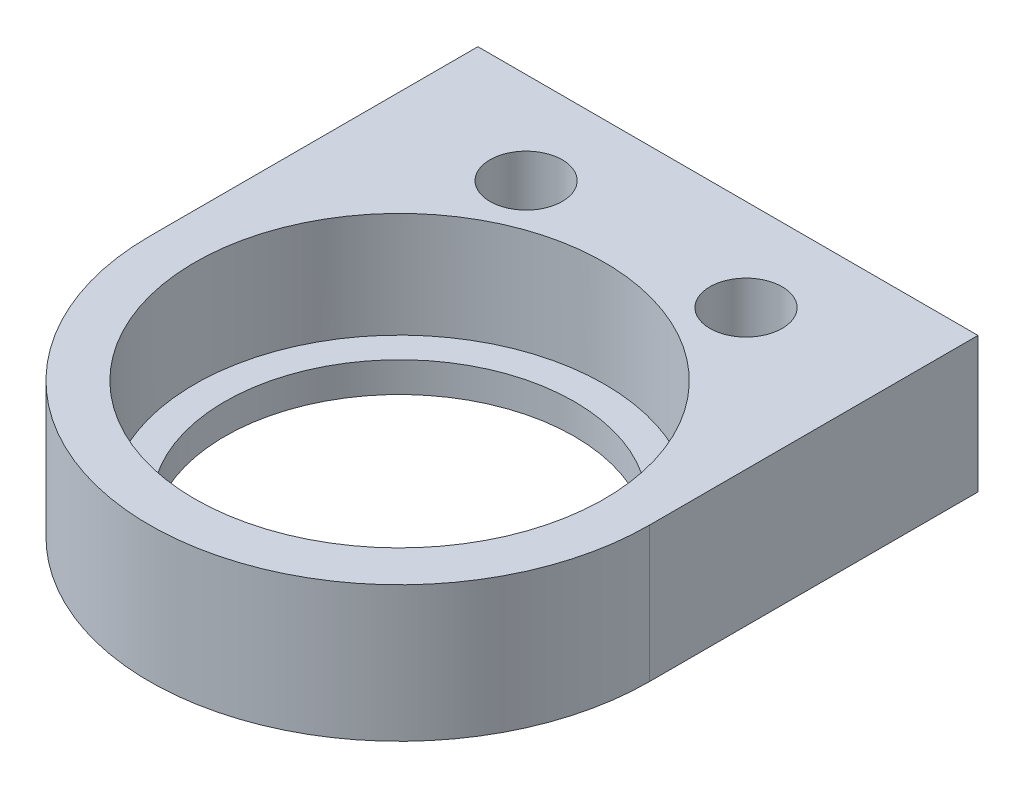
ISO-10303-21;
HEADER;
FILE_DESCRIPTION(('STEP AP214'),'2;1');
FILE_NAME('part.step','',(''),(''),'','','');
FILE_SCHEMA(('AUTOMOTIVE_DESIGN { 1 0 10303 214 1 1 1 1 }'));
ENDSEC;
DATA;
#1=APPLICATION_CONTEXT('core data for automotive mechanical design processes');
#2=APPLICATION_PROTOCOL_DEFINITION('international standard','automotive_design',2000,#1);
#3=PRODUCT_CONTEXT('',#1,'mechanical');
#4=PRODUCT('Part','Part','',(#3));
#5=PRODUCT_RELATED_PRODUCT_CATEGORY('part','',(#4));
#6=PRODUCT_DEFINITION_FORMATION('','',#4);
#7=PRODUCT_DEFINITION_CONTEXT('part definition',#1,'design');
#8=PRODUCT_DEFINITION('design','',#6,#7);
#9=PRODUCT_DEFINITION_SHAPE('','',#8);
#10=(LENGTH_UNIT() NAMED_UNIT(*) SI_UNIT(.MILLI.,.METRE.));
#11=(NAMED_UNIT(*) PLANE_ANGLE_UNIT() SI_UNIT($,.RADIAN.));
#12=(NAMED_UNIT(*) SI_UNIT($,.STERADIAN.) SOLID_ANGLE_UNIT());
#13=UNCERTAINTY_MEASURE_WITH_UNIT(LENGTH_MEASURE(1.E-05),#10,'distance_accuracy_value','');
#14=(GEOMETRIC_REPRESENTATION_CONTEXT(3) GLOBAL_UNCERTAINTY_ASSIGNED_CONTEXT((#13)) GLOBAL_UNIT_ASSIGNED_CONTEXT((#10,
#11,#12)) REPRESENTATION_CONTEXT('',''));
#15=CARTESIAN_POINT('',(0.,0.,0.));
#16=DIRECTION('',(0.,0.,1.));
#17=DIRECTION('',(1.,0.,0.));
#18=AXIS2_PLACEMENT_3D('',#15,#16,#17);
#19=CARTESIAN_POINT('',(0.,4.445,0.));
#20=DIRECTION('',(0.,-1.,0.));
#21=DIRECTION('',(0.,0.,-1.));
#22=AXIS2_PLACEMENT_3D('',#19,#20,#21);
#23=PLANE('',#22);
#24=CARTESIAN_POINT('',(4.6355,4.445,-9.9695));
#25=DIRECTION('',(0.,1.,0.));
#26=DIRECTION('',(0.,0.,1.));
#27=AXIS2_PLACEMENT_3D('',#24,#25,#26);
#28=CIRCLE('',#27,1.524);
#29=CARTESIAN_POINT('',(4.6355,4.445,-8.4455));
#30=VERTEX_POINT('',#29);
#31=EDGE_CURVE('E128',#30,#30,#28,.T.);
#32=ORIENTED_EDGE('',*,*,#31,.F.);
#33=EDGE_LOOP('',(#32));
#34=FACE_BOUND('',#33,.T.);
#35=CARTESIAN_POINT('',(-4.6355,4.445,-9.9695));
#36=DIRECTION('',(0.,1.,0.));
#37=DIRECTION('',(0.,0.,-1.));
#38=AXIS2_PLACEMENT_3D('',#35,#36,#37);
#39=CIRCLE('',#38,1.524);
#40=CARTESIAN_POINT('',(-4.6355,4.445,-11.4935));
#41=VERTEX_POINT('',#40);
#42=EDGE_CURVE('E122',#41,#41,#39,.T.);
#43=ORIENTED_EDGE('',*,*,#42,.F.);
#44=EDGE_LOOP('',(#43));
#45=FACE_BOUND('',#44,.T.);
#46=CARTESIAN_POINT('',(0.,4.445,0.));
#47=DIRECTION('',(0.,1.,0.));
#48=DIRECTION('',(0.,0.,1.));
#49=AXIS2_PLACEMENT_3D('',#46,#47,#48);
#50=CIRCLE('',#49,8.636);
#51=CARTESIAN_POINT('',(0.,4.445,8.636));
#52=VERTEX_POINT('',#51);
#53=EDGE_CURVE('E118',#52,#52,#50,.T.);
#54=ORIENTED_EDGE('',*,*,#53,.F.);
#55=EDGE_LOOP('',(#54));
#56=FACE_BOUND('',#55,.T.);
#57=DIRECTION('',(0.,0.,-1.));
#58=VECTOR('',#57,1.);
#59=CARTESIAN_POINT('',(10.541,4.445,0.));
#60=LINE('',#59,#58);
#61=CARTESIAN_POINT('',(10.541,4.445,0.));
#62=VERTEX_POINT('',#61);
#63=CARTESIAN_POINT('',(10.541,4.445,-13.843));
#64=VERTEX_POINT('',#63);
#65=EDGE_CURVE('E54',#62,#64,#60,.T.);
#66=ORIENTED_EDGE('',*,*,#65,.T.);
#67=DIRECTION('',(-1.,0.,0.));
#68=VECTOR('',#67,1.);
#69=CARTESIAN_POINT('',(7.36599999999999,4.445,-13.843));
#70=LINE('',#69,#68);
#71=CARTESIAN_POINT('',(-10.541,4.445,-13.843));
#72=VERTEX_POINT('',#71);
#73=EDGE_CURVE('E71',#64,#72,#70,.T.);
#74=ORIENTED_EDGE('',*,*,#73,.T.);
#75=DIRECTION('',(0.,0.,1.));
#76=VECTOR('',#75,1.);
#77=CARTESIAN_POINT('',(-10.541,4.445,0.));
#78=LINE('',#77,#76);
#79=CARTESIAN_POINT('',(-10.541,4.445,0.));
#80=VERTEX_POINT('',#79);
#81=EDGE_CURVE('E47',#72,#80,#78,.T.);
#82=ORIENTED_EDGE('',*,*,#81,.T.);
#83=CARTESIAN_POINT('',(0.,4.445,0.));
#84=DIRECTION('',(0.,1.,0.));
#85=DIRECTION('',(0.,0.,-1.));
#86=AXIS2_PLACEMENT_3D('',#83,#84,#85);
#87=CIRCLE('',#86,10.541);
#88=EDGE_CURVE('E73',#80,#62,#87,.T.);
#89=ORIENTED_EDGE('',*,*,#88,.T.);
#90=EDGE_LOOP('',(#66,#74,#82,#89));
#91=FACE_BOUND('',#90,.T.);
#92=ADVANCED_FACE('F32',(#34,#45,#56,#91),#23,.F.);
#93=CARTESIAN_POINT('',(0.,4.445,0.));
#94=DIRECTION('',(0.,-1.,0.));
#95=DIRECTION('',(0.,0.,-1.));
#96=AXIS2_PLACEMENT_3D('',#93,#94,#95);
#97=CYLINDRICAL_SURFACE('',#96,10.541);
#98=DIRECTION('',(0.,-1.,0.));
#99=VECTOR('',#98,1.);
#100=CARTESIAN_POINT('',(-10.541,4.445,0.));
#101=LINE('',#100,#99);
#102=CARTESIAN_POINT('',(-10.541,-1.27,0.));
#103=VERTEX_POINT('',#102);
#104=EDGE_CURVE('E40',#80,#103,#101,.T.);
#105=ORIENTED_EDGE('',*,*,#104,.T.);
#106=CARTESIAN_POINT('',(0.,-1.27,0.));
#107=DIRECTION('',(0.,-1.,0.));
#108=DIRECTION('',(0.,0.,-1.));
#109=AXIS2_PLACEMENT_3D('',#106,#107,#108);
#110=CIRCLE('',#109,10.541);
#111=CARTESIAN_POINT('',(10.541,-1.27,0.));
#112=VERTEX_POINT('',#111);
#113=EDGE_CURVE('E95',#112,#103,#110,.T.);
#114=ORIENTED_EDGE('',*,*,#113,.F.);
#115=DIRECTION('',(0.,-1.,0.));
#116=VECTOR('',#115,1.);
#117=CARTESIAN_POINT('',(10.541,4.445,0.));
#118=LINE('',#117,#116);
#119=EDGE_CURVE('E11',#62,#112,#118,.T.);
#120=ORIENTED_EDGE('',*,*,#119,.F.);
#121=ORIENTED_EDGE('',*,*,#88,.F.);
#122=EDGE_LOOP('',(#105,#114,#120,#121));
#123=FACE_BOUND('',#122,.T.);
#124=ADVANCED_FACE('F34',(#123),#97,.T.);
#125=CARTESIAN_POINT('',(10.541,4.445,0.));
#126=DIRECTION('',(-1.,0.,0.));
#127=DIRECTION('',(0.,0.,1.));
#128=AXIS2_PLACEMENT_3D('',#125,#126,#127);
#129=PLANE('',#128);
#130=ORIENTED_EDGE('',*,*,#119,.T.);
#131=DIRECTION('',(0.,0.,1.));
#132=VECTOR('',#131,1.);
#133=CARTESIAN_POINT('',(10.541,-1.27,-10.668));
#134=LINE('',#133,#132);
#135=CARTESIAN_POINT('',(10.541,-1.27,-13.843));
#136=VERTEX_POINT('',#135);
#137=EDGE_CURVE('E81',#136,#112,#134,.T.);
#138=ORIENTED_EDGE('',*,*,#137,.F.);
#139=DIRECTION('',(0.,1.,0.));
#140=VECTOR('',#139,1.);
#141=CARTESIAN_POINT('',(10.541,-1.27,-13.843));
#142=LINE('',#141,#140);
#143=EDGE_CURVE('E78',#136,#64,#142,.T.);
#144=ORIENTED_EDGE('',*,*,#143,.T.);
#145=ORIENTED_EDGE('',*,*,#65,.F.);
#146=EDGE_LOOP('',(#130,#138,#144,#145));
#147=FACE_BOUND('',#146,.T.);
#148=ADVANCED_FACE('F79',(#147),#129,.F.);
#149=CARTESIAN_POINT('',(-7.36599999999999,4.445,-13.843));
#150=DIRECTION('',(0.,0.,1.));
#151=DIRECTION('',(1.,0.,0.));
#152=AXIS2_PLACEMENT_3D('',#149,#150,#151);
#153=PLANE('',#152);
#154=ORIENTED_EDGE('',*,*,#73,.F.);
#155=ORIENTED_EDGE('',*,*,#143,.F.);
#156=DIRECTION('',(1.,0.,0.));
#157=VECTOR('',#156,1.);
#158=CARTESIAN_POINT('',(-10.541,-1.27,-13.843));
#159=LINE('',#158,#157);
#160=CARTESIAN_POINT('',(-10.541,-1.27,-13.843));
#161=VERTEX_POINT('',#160);
#162=EDGE_CURVE('E100',#161,#136,#159,.T.);
#163=ORIENTED_EDGE('',*,*,#162,.F.);
#164=DIRECTION('',(0.,1.,0.));
#165=VECTOR('',#164,1.);
#166=CARTESIAN_POINT('',(-10.541,-1.27,-13.843));
#167=LINE('',#166,#165);
#168=EDGE_CURVE('E84',#161,#72,#167,.T.);
#169=ORIENTED_EDGE('',*,*,#168,.T.);
#170=EDGE_LOOP('',(#154,#155,#163,#169));
#171=FACE_BOUND('',#170,.T.);
#172=ADVANCED_FACE('F86',(#171),#153,.F.);
#173=CARTESIAN_POINT('',(-10.541,4.445,0.));
#174=DIRECTION('',(1.,0.,0.));
#175=DIRECTION('',(0.,0.,-1.));
#176=AXIS2_PLACEMENT_3D('',#173,#174,#175);
#177=PLANE('',#176);
#178=ORIENTED_EDGE('',*,*,#81,.F.);
#179=ORIENTED_EDGE('',*,*,#168,.F.);
#180=DIRECTION('',(0.,0.,-1.));
#181=VECTOR('',#180,1.);
#182=CARTESIAN_POINT('',(-10.541,-1.27,0.));
#183=LINE('',#182,#181);
#184=EDGE_CURVE('E97',#103,#161,#183,.T.);
#185=ORIENTED_EDGE('',*,*,#184,.F.);
#186=ORIENTED_EDGE('',*,*,#104,.F.);
#187=EDGE_LOOP('',(#178,#179,#185,#186));
#188=FACE_BOUND('',#187,.T.);
#189=ADVANCED_FACE('F98',(#188),#177,.F.);
#190=CARTESIAN_POINT('',(0.,-1.27,0.));
#191=DIRECTION('',(0.,-1.,0.));
#192=DIRECTION('',(0.,0.,-1.));
#193=AXIS2_PLACEMENT_3D('',#190,#191,#192);
#194=PLANE('',#193);
#195=CARTESIAN_POINT('',(4.6355,-1.27,-9.9695));
#196=DIRECTION('',(0.,1.,0.));
#197=DIRECTION('',(0.,0.,1.));
#198=AXIS2_PLACEMENT_3D('',#195,#196,#197);
#199=CIRCLE('',#198,1.524);
#200=CARTESIAN_POINT('',(4.6355,-1.27,-8.4455));
#201=VERTEX_POINT('',#200);
#202=EDGE_CURVE('E121',#201,#201,#199,.T.);
#203=ORIENTED_EDGE('',*,*,#202,.T.);
#204=EDGE_LOOP('',(#203));
#205=FACE_BOUND('',#204,.T.);
#206=CARTESIAN_POINT('',(-4.6355,-1.27,-9.9695));
#207=DIRECTION('',(0.,1.,0.));
#208=DIRECTION('',(0.,0.,-1.));
#209=AXIS2_PLACEMENT_3D('',#206,#207,#208);
#210=CIRCLE('',#209,1.524);
#211=CARTESIAN_POINT('',(-4.6355,-1.27,-11.4935));
#212=VERTEX_POINT('',#211);
#213=EDGE_CURVE('E125',#212,#212,#210,.T.);
#214=ORIENTED_EDGE('',*,*,#213,.T.);
#215=EDGE_LOOP('',(#214));
#216=FACE_BOUND('',#215,.T.);
#217=ORIENTED_EDGE('',*,*,#113,.T.);
#218=ORIENTED_EDGE('',*,*,#184,.T.);
#219=ORIENTED_EDGE('',*,*,#162,.T.);
#220=ORIENTED_EDGE('',*,*,#137,.T.);
#221=EDGE_LOOP('',(#217,#218,#219,#220));
#222=FACE_BOUND('',#221,.T.);
#223=CARTESIAN_POINT('',(0.,-1.27,0.));
#224=DIRECTION('',(0.,-1.,0.));
#225=DIRECTION('',(0.,0.,-1.));
#226=AXIS2_PLACEMENT_3D('',#223,#224,#225);
#227=CIRCLE('',#226,7.366);
#228=CARTESIAN_POINT('',(0.,-1.27,-7.366));
#229=VERTEX_POINT('',#228);
#230=EDGE_CURVE('E104',#229,#229,#227,.T.);
#231=ORIENTED_EDGE('',*,*,#230,.F.);
#232=EDGE_LOOP('',(#231));
#233=FACE_BOUND('',#232,.T.);
#234=ADVANCED_FACE('F102',(#205,#216,#222,#233),#194,.T.);
#235=CARTESIAN_POINT('',(0.,-1.27,0.));
#236=DIRECTION('',(0.,1.,0.));
#237=DIRECTION('',(0.,0.,1.));
#238=AXIS2_PLACEMENT_3D('',#235,#236,#237);
#239=CYLINDRICAL_SURFACE('',#238,7.366);
#240=ORIENTED_EDGE('',*,*,#230,.T.);
#241=EDGE_LOOP('',(#240));
#242=FACE_BOUND('',#241,.T.);
#243=CARTESIAN_POINT('',(0.,0.,0.));
#244=DIRECTION('',(0.,-1.,0.));
#245=DIRECTION('',(0.,0.,-1.));
#246=AXIS2_PLACEMENT_3D('',#243,#244,#245);
#247=CIRCLE('',#246,7.366);
#248=CARTESIAN_POINT('',(0.,0.,-7.366));
#249=VERTEX_POINT('',#248);
#250=EDGE_CURVE('E107',#249,#249,#247,.T.);
#251=ORIENTED_EDGE('',*,*,#250,.F.);
#252=EDGE_LOOP('',(#251));
#253=FACE_BOUND('',#252,.T.);
#254=ADVANCED_FACE('F158',(#242,#253),#239,.F.);
#255=CARTESIAN_POINT('',(0.,0.,0.));
#256=DIRECTION('',(0.,-1.,0.));
#257=DIRECTION('',(0.,0.,-1.));
#258=AXIS2_PLACEMENT_3D('',#255,#256,#257);
#259=PLANE('',#258);
#260=ORIENTED_EDGE('',*,*,#250,.T.);
#261=EDGE_LOOP('',(#260));
#262=FACE_BOUND('',#261,.T.);
#263=CARTESIAN_POINT('',(0.,0.,0.));
#264=DIRECTION('',(0.,-1.,0.));
#265=DIRECTION('',(0.,0.,-1.));
#266=AXIS2_PLACEMENT_3D('',#263,#264,#265);
#267=CIRCLE('',#266,8.636);
#268=CARTESIAN_POINT('',(0.,0.,-8.636));
#269=VERTEX_POINT('',#268);
#270=EDGE_CURVE('E115',#269,#269,#267,.F.);
#271=ORIENTED_EDGE('',*,*,#270,.T.);
#272=EDGE_LOOP('',(#271));
#273=FACE_BOUND('',#272,.T.);
#274=ADVANCED_FACE('F153',(#262,#273),#259,.F.);
#275=CARTESIAN_POINT('',(0.,-24.4262966493081,0.));
#276=DIRECTION('',(0.,1.,0.));
#277=DIRECTION('',(0.,0.,1.));
#278=AXIS2_PLACEMENT_3D('',#275,#276,#277);
#279=CYLINDRICAL_SURFACE('',#278,8.636);
#280=ORIENTED_EDGE('',*,*,#53,.T.);
#281=EDGE_LOOP('',(#280));
#282=FACE_BOUND('',#281,.T.);
#283=ORIENTED_EDGE('',*,*,#270,.F.);
#284=EDGE_LOOP('',(#283));
#285=FACE_BOUND('',#284,.T.);
#286=ADVANCED_FACE('F150',(#282,#285),#279,.F.);
#287=CARTESIAN_POINT('',(-4.6355,-1.27,-9.9695));
#288=DIRECTION('',(0.,1.,0.));
#289=DIRECTION('',(0.,0.,1.));
#290=AXIS2_PLACEMENT_3D('',#287,#288,#289);
#291=CYLINDRICAL_SURFACE('',#290,1.524);
#292=ORIENTED_EDGE('',*,*,#213,.F.);
#293=EDGE_LOOP('',(#292));
#294=FACE_BOUND('',#293,.T.);
#295=ORIENTED_EDGE('',*,*,#42,.T.);
#296=EDGE_LOOP('',(#295));
#297=FACE_BOUND('',#296,.T.);
#298=ADVANCED_FACE('F139',(#294,#297),#291,.F.);
#299=CARTESIAN_POINT('',(4.6355,-1.27,-9.9695));
#300=DIRECTION('',(0.,1.,0.));
#301=DIRECTION('',(0.,0.,1.));
#302=AXIS2_PLACEMENT_3D('',#299,#300,#301);
#303=CYLINDRICAL_SURFACE('',#302,1.524);
#304=ORIENTED_EDGE('',*,*,#202,.F.);
#305=EDGE_LOOP('',(#304));
#306=FACE_BOUND('',#305,.T.);
#307=ORIENTED_EDGE('',*,*,#31,.T.);
#308=EDGE_LOOP('',(#307));
#309=FACE_BOUND('',#308,.T.);
#310=ADVANCED_FACE('F136',(#306,#309),#303,.F.);
#311=CLOSED_SHELL('',(#92,#124,#148,#172,#189,#234,#254,#274,#286,#298,#310));
#312=MANIFOLD_SOLID_BREP('B2',#311);
#313=ADVANCED_BREP_SHAPE_REPRESENTATION('',(#18,#312),#14);
#314=SHAPE_DEFINITION_REPRESENTATION(#9,#313);
ENDSEC;
END-ISO-10303-21;
